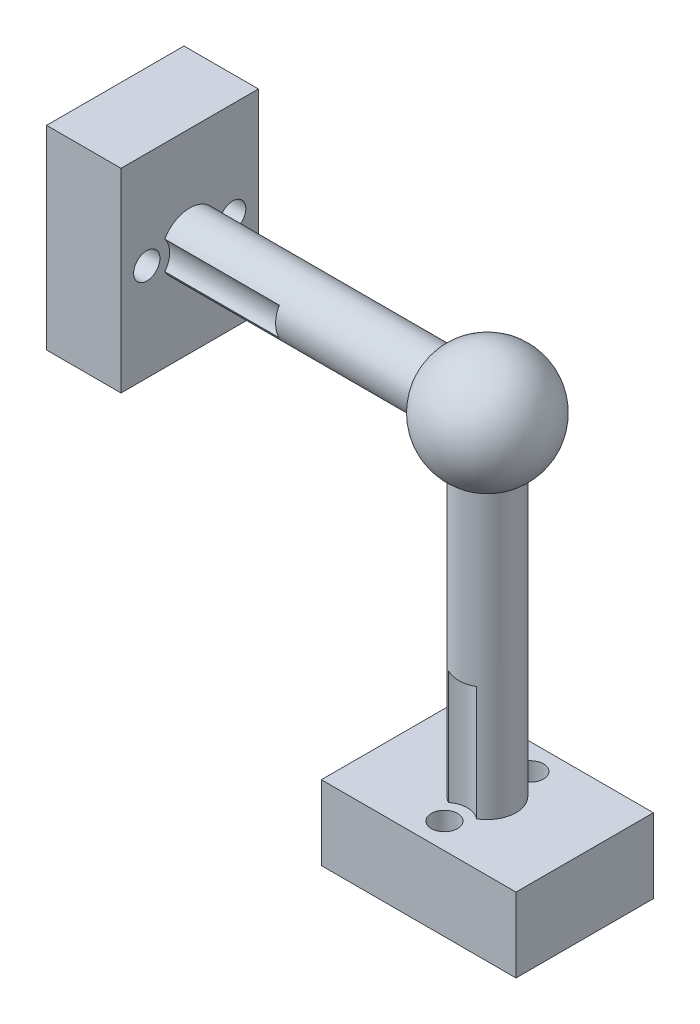
ISO-10303-21;
HEADER;
FILE_DESCRIPTION(('STEP AP214'),'2;1');
FILE_NAME('part.step','',(''),(''),'','','');
FILE_SCHEMA(('AUTOMOTIVE_DESIGN { 1 0 10303 214 1 1 1 1 }'));
ENDSEC;
DATA;
#1=APPLICATION_CONTEXT('core data for automotive mechanical design processes');
#2=APPLICATION_PROTOCOL_DEFINITION('international standard','automotive_design',2000,#1);
#3=PRODUCT_CONTEXT('',#1,'mechanical');
#4=PRODUCT('Part','Part','',(#3));
#5=PRODUCT_RELATED_PRODUCT_CATEGORY('part','',(#4));
#6=PRODUCT_DEFINITION_FORMATION('','',#4);
#7=PRODUCT_DEFINITION_CONTEXT('part definition',#1,'design');
#8=PRODUCT_DEFINITION('design','',#6,#7);
#9=PRODUCT_DEFINITION_SHAPE('','',#8);
#10=(LENGTH_UNIT() NAMED_UNIT(*) SI_UNIT(.MILLI.,.METRE.));
#11=(NAMED_UNIT(*) PLANE_ANGLE_UNIT() SI_UNIT($,.RADIAN.));
#12=(NAMED_UNIT(*) SI_UNIT($,.STERADIAN.) SOLID_ANGLE_UNIT());
#13=UNCERTAINTY_MEASURE_WITH_UNIT(LENGTH_MEASURE(1.E-05),#10,'distance_accuracy_value','');
#14=(GEOMETRIC_REPRESENTATION_CONTEXT(3) GLOBAL_UNCERTAINTY_ASSIGNED_CONTEXT((#13)) GLOBAL_UNIT_ASSIGNED_CONTEXT((#10,
#11,#12)) REPRESENTATION_CONTEXT('',''));
#15=CARTESIAN_POINT('',(0.,0.,0.));
#16=DIRECTION('',(0.,0.,1.));
#17=DIRECTION('',(1.,0.,0.));
#18=AXIS2_PLACEMENT_3D('',#15,#16,#17);
#19=CARTESIAN_POINT('',(-26.,0.,0.));
#20=DIRECTION('',(1.,0.,0.));
#21=DIRECTION('',(0.,0.,-1.));
#22=AXIS2_PLACEMENT_3D('',#19,#20,#21);
#23=CYLINDRICAL_SURFACE('',#22,2.5);
#24=CARTESIAN_POINT('',(-4.3301270189222,0.,0.));
#25=DIRECTION('',(1.,0.,0.));
#26=DIRECTION('',(0.,0.,-1.));
#27=AXIS2_PLACEMENT_3D('',#24,#25,#26);
#28=CIRCLE('',#27,2.5);
#29=CARTESIAN_POINT('',(-4.3301270189222,0.,-2.5));
#30=VERTEX_POINT('',#29);
#31=EDGE_CURVE('E240',#30,#30,#28,.F.);
#32=ORIENTED_EDGE('',*,*,#31,.T.);
#33=EDGE_LOOP('',(#32));
#34=FACE_BOUND('',#33,.T.);
#35=CARTESIAN_POINT('',(-16.,0.,0.));
#36=DIRECTION('',(1.,0.,0.));
#37=DIRECTION('',(0.,0.,-1.));
#38=AXIS2_PLACEMENT_3D('',#35,#36,#37);
#39=CIRCLE('',#38,2.5);
#40=CARTESIAN_POINT('',(-16.,1.23262930356211,-2.175));
#41=VERTEX_POINT('',#40);
#42=CARTESIAN_POINT('',(-16.,-1.23262930356211,-2.175));
#43=VERTEX_POINT('',#42);
#44=EDGE_CURVE('E11',#41,#43,#39,.F.);
#45=ORIENTED_EDGE('',*,*,#44,.F.);
#46=DIRECTION('',(-1.,0.,0.));
#47=VECTOR('',#46,1.);
#48=CARTESIAN_POINT('',(-21.,1.23262930356211,-2.175));
#49=LINE('',#48,#47);
#50=CARTESIAN_POINT('',(-26.,1.23262930356211,-2.175));
#51=VERTEX_POINT('',#50);
#52=EDGE_CURVE('E145',#41,#51,#49,.T.);
#53=ORIENTED_EDGE('',*,*,#52,.T.);
#54=CARTESIAN_POINT('',(-26.,0.,0.));
#55=DIRECTION('',(1.,0.,0.));
#56=DIRECTION('',(0.,0.,-1.));
#57=AXIS2_PLACEMENT_3D('',#54,#55,#56);
#58=CIRCLE('',#57,2.5);
#59=CARTESIAN_POINT('',(-26.,1.23262930356211,2.175));
#60=VERTEX_POINT('',#59);
#61=EDGE_CURVE('E156',#60,#51,#58,.F.);
#62=ORIENTED_EDGE('',*,*,#61,.F.);
#63=DIRECTION('',(-1.,0.,0.));
#64=VECTOR('',#63,1.);
#65=CARTESIAN_POINT('',(-21.,1.23262930356211,2.175));
#66=LINE('',#65,#64);
#67=CARTESIAN_POINT('',(-16.,1.23262930356211,2.175));
#68=VERTEX_POINT('',#67);
#69=EDGE_CURVE('E255',#60,#68,#66,.F.);
#70=ORIENTED_EDGE('',*,*,#69,.T.);
#71=CARTESIAN_POINT('',(-16.,0.,0.));
#72=DIRECTION('',(1.,0.,0.));
#73=DIRECTION('',(0.,0.,-1.));
#74=AXIS2_PLACEMENT_3D('',#71,#72,#73);
#75=CIRCLE('',#74,2.5);
#76=CARTESIAN_POINT('',(-16.,-1.23262930356211,2.175));
#77=VERTEX_POINT('',#76);
#78=EDGE_CURVE('E41',#77,#68,#75,.F.);
#79=ORIENTED_EDGE('',*,*,#78,.F.);
#80=DIRECTION('',(-1.,0.,0.));
#81=VECTOR('',#80,1.);
#82=CARTESIAN_POINT('',(-21.,-1.23262930356211,2.175));
#83=LINE('',#82,#81);
#84=CARTESIAN_POINT('',(-26.,-1.23262930356211,2.175));
#85=VERTEX_POINT('',#84);
#86=EDGE_CURVE('E256',#77,#85,#83,.T.);
#87=ORIENTED_EDGE('',*,*,#86,.T.);
#88=CARTESIAN_POINT('',(-26.,-1.23262930356211,-2.175));
#89=VERTEX_POINT('',#88);
#90=EDGE_CURVE('E161',#89,#85,#58,.F.);
#91=ORIENTED_EDGE('',*,*,#90,.F.);
#92=DIRECTION('',(-1.,0.,0.));
#93=VECTOR('',#92,1.);
#94=CARTESIAN_POINT('',(-21.,-1.23262930356211,-2.175));
#95=LINE('',#94,#93);
#96=EDGE_CURVE('E148',#89,#43,#95,.F.);
#97=ORIENTED_EDGE('',*,*,#96,.T.);
#98=EDGE_LOOP('',(#45,#53,#62,#70,#79,#87,#91,#97));
#99=FACE_BOUND('',#98,.T.);
#100=ADVANCED_FACE('F33',(#34,#99),#23,.T.);
#101=CARTESIAN_POINT('',(0.,-29.,0.));
#102=DIRECTION('',(0.,1.,0.));
#103=DIRECTION('',(0.,0.,1.));
#104=AXIS2_PLACEMENT_3D('',#101,#102,#103);
#105=CYLINDRICAL_SURFACE('',#104,2.5);
#106=CARTESIAN_POINT('',(0.,-4.3301270189222,0.));
#107=DIRECTION('',(0.,1.,0.));
#108=DIRECTION('',(0.,0.,1.));
#109=AXIS2_PLACEMENT_3D('',#106,#107,#108);
#110=CIRCLE('',#109,2.5);
#111=CARTESIAN_POINT('',(0.,-4.3301270189222,2.5));
#112=VERTEX_POINT('',#111);
#113=EDGE_CURVE('E237',#112,#112,#110,.F.);
#114=ORIENTED_EDGE('',*,*,#113,.T.);
#115=EDGE_LOOP('',(#114));
#116=FACE_BOUND('',#115,.T.);
#117=CARTESIAN_POINT('',(0.,-19.,0.));
#118=DIRECTION('',(0.,1.,0.));
#119=DIRECTION('',(-1.,0.,0.));
#120=AXIS2_PLACEMENT_3D('',#117,#118,#119);
#121=CIRCLE('',#120,2.5);
#122=CARTESIAN_POINT('',(1.23262930356202,-19.,2.17500000000005));
#123=VERTEX_POINT('',#122);
#124=CARTESIAN_POINT('',(-1.23262930356219,-19.,2.17499999999995));
#125=VERTEX_POINT('',#124);
#126=EDGE_CURVE('E245',#123,#125,#121,.F.);
#127=ORIENTED_EDGE('',*,*,#126,.F.);
#128=DIRECTION('',(0.,-1.,0.));
#129=VECTOR('',#128,1.);
#130=CARTESIAN_POINT('',(1.232629303562,-24.,2.17500000000006));
#131=LINE('',#130,#129);
#132=CARTESIAN_POINT('',(1.23262930356198,-29.,2.17500000000007));
#133=VERTEX_POINT('',#132);
#134=EDGE_CURVE('E174',#123,#133,#131,.T.);
#135=ORIENTED_EDGE('',*,*,#134,.T.);
#136=CARTESIAN_POINT('',(0.,-29.,0.));
#137=DIRECTION('',(0.,-1.,0.));
#138=DIRECTION('',(1.,0.,0.));
#139=AXIS2_PLACEMENT_3D('',#136,#137,#138);
#140=CIRCLE('',#139,2.5);
#141=CARTESIAN_POINT('',(1.23262930356198,-29.,-2.17500000000007));
#142=VERTEX_POINT('',#141);
#143=EDGE_CURVE('E228',#133,#142,#140,.F.);
#144=ORIENTED_EDGE('',*,*,#143,.T.);
#145=DIRECTION('',(0.,-1.,0.));
#146=VECTOR('',#145,1.);
#147=CARTESIAN_POINT('',(1.232629303562,-24.,-2.17500000000006));
#148=LINE('',#147,#146);
#149=CARTESIAN_POINT('',(1.23262930356202,-19.,-2.17500000000005));
#150=VERTEX_POINT('',#149);
#151=EDGE_CURVE('E181',#142,#150,#148,.F.);
#152=ORIENTED_EDGE('',*,*,#151,.T.);
#153=CARTESIAN_POINT('',(0.,-19.,0.));
#154=DIRECTION('',(0.,1.,0.));
#155=DIRECTION('',(-1.,0.,0.));
#156=AXIS2_PLACEMENT_3D('',#153,#154,#155);
#157=CIRCLE('',#156,2.5);
#158=CARTESIAN_POINT('',(-1.23262930356219,-19.,-2.17499999999995));
#159=VERTEX_POINT('',#158);
#160=EDGE_CURVE('E243',#159,#150,#157,.F.);
#161=ORIENTED_EDGE('',*,*,#160,.F.);
#162=DIRECTION('',(0.,-1.,0.));
#163=VECTOR('',#162,1.);
#164=CARTESIAN_POINT('',(-1.23262930356221,-24.,-2.17499999999994));
#165=LINE('',#164,#163);
#166=CARTESIAN_POINT('',(-1.23262930356223,-29.,-2.17499999999993));
#167=VERTEX_POINT('',#166);
#168=EDGE_CURVE('E186',#159,#167,#165,.T.);
#169=ORIENTED_EDGE('',*,*,#168,.T.);
#170=CARTESIAN_POINT('',(-1.23262930356223,-29.,2.17499999999993));
#171=VERTEX_POINT('',#170);
#172=EDGE_CURVE('E234',#167,#171,#140,.F.);
#173=ORIENTED_EDGE('',*,*,#172,.T.);
#174=DIRECTION('',(0.,-1.,0.));
#175=VECTOR('',#174,1.);
#176=CARTESIAN_POINT('',(-1.23262930356221,-24.,2.17499999999994));
#177=LINE('',#176,#175);
#178=EDGE_CURVE('E170',#171,#125,#177,.F.);
#179=ORIENTED_EDGE('',*,*,#178,.T.);
#180=EDGE_LOOP('',(#127,#135,#144,#152,#161,#169,#173,#179));
#181=FACE_BOUND('',#180,.T.);
#182=ADVANCED_FACE('F344',(#116,#181),#105,.T.);
#183=CARTESIAN_POINT('',(0.,0.,0.));
#184=DIRECTION('',(0.,1.,0.));
#185=DIRECTION('',(1.,0.,0.));
#186=AXIS2_PLACEMENT_3D('',#183,#184,#185);
#187=SPHERICAL_SURFACE('',#186,5.);
#188=ORIENTED_EDGE('',*,*,#31,.F.);
#189=EDGE_LOOP('',(#188));
#190=FACE_BOUND('',#189,.T.);
#191=ORIENTED_EDGE('',*,*,#113,.F.);
#192=EDGE_LOOP('',(#191));
#193=FACE_BOUND('',#192,.T.);
#194=ADVANCED_FACE('F35',(#190,#193),#187,.T.);
#195=CARTESIAN_POINT('',(8.49999999999984,-29.0000000000001,-6.));
#196=DIRECTION('',(1.,0.,0.));
#197=DIRECTION('',(0.,1.,0.));
#198=AXIS2_PLACEMENT_3D('',#195,#196,#197);
#199=PLANE('',#198);
#200=DIRECTION('',(0.,0.,1.));
#201=VECTOR('',#200,1.);
#202=CARTESIAN_POINT('',(8.49999999999979,-35.5000000000001,-6.));
#203=LINE('',#202,#201);
#204=CARTESIAN_POINT('',(8.49999999999979,-35.5000000000001,-6.));
#205=VERTEX_POINT('',#204);
#206=CARTESIAN_POINT('',(8.49999999999979,-35.5000000000001,6.));
#207=VERTEX_POINT('',#206);
#208=EDGE_CURVE('E199',#205,#207,#203,.T.);
#209=ORIENTED_EDGE('',*,*,#208,.F.);
#210=DIRECTION('',(0.,-1.,0.));
#211=VECTOR('',#210,1.);
#212=CARTESIAN_POINT('',(8.49999999999984,-29.0000000000001,-6.));
#213=LINE('',#212,#211);
#214=CARTESIAN_POINT('',(8.49999999999984,-29.0000000000001,-6.));
#215=VERTEX_POINT('',#214);
#216=EDGE_CURVE('E226',#215,#205,#213,.T.);
#217=ORIENTED_EDGE('',*,*,#216,.F.);
#218=DIRECTION('',(0.,0.,1.));
#219=VECTOR('',#218,1.);
#220=CARTESIAN_POINT('',(8.49999999999984,-29.0000000000001,-6.));
#221=LINE('',#220,#219);
#222=CARTESIAN_POINT('',(8.49999999999983,-29.0000000000001,6.));
#223=VERTEX_POINT('',#222);
#224=EDGE_CURVE('E202',#215,#223,#221,.T.);
#225=ORIENTED_EDGE('',*,*,#224,.T.);
#226=DIRECTION('',(0.,-1.,0.));
#227=VECTOR('',#226,1.);
#228=CARTESIAN_POINT('',(8.49999999999983,-29.0000000000001,6.));
#229=LINE('',#228,#227);
#230=EDGE_CURVE('E215',#223,#207,#229,.T.);
#231=ORIENTED_EDGE('',*,*,#230,.T.);
#232=EDGE_LOOP('',(#209,#217,#225,#231));
#233=FACE_BOUND('',#232,.T.);
#234=ADVANCED_FACE('F352',(#233),#199,.T.);
#235=CARTESIAN_POINT('',(8.49999999999984,-29.0000000000001,-6.));
#236=DIRECTION('',(0.,0.,-1.));
#237=DIRECTION('',(-1.,0.,0.));
#238=AXIS2_PLACEMENT_3D('',#235,#236,#237);
#239=PLANE('',#238);
#240=DIRECTION('',(1.,0.,0.));
#241=VECTOR('',#240,1.);
#242=CARTESIAN_POINT('',(8.49999999999979,-35.5000000000001,-6.));
#243=LINE('',#242,#241);
#244=CARTESIAN_POINT('',(-8.50000000000021,-35.4999999999999,-6.));
#245=VERTEX_POINT('',#244);
#246=EDGE_CURVE('E206',#245,#205,#243,.T.);
#247=ORIENTED_EDGE('',*,*,#246,.F.);
#248=DIRECTION('',(0.,-1.,0.));
#249=VECTOR('',#248,1.);
#250=CARTESIAN_POINT('',(-8.50000000000016,-28.9999999999999,-6.));
#251=LINE('',#250,#249);
#252=CARTESIAN_POINT('',(-8.50000000000016,-28.9999999999999,-6.));
#253=VERTEX_POINT('',#252);
#254=EDGE_CURVE('E229',#253,#245,#251,.T.);
#255=ORIENTED_EDGE('',*,*,#254,.F.);
#256=DIRECTION('',(1.,0.,0.));
#257=VECTOR('',#256,1.);
#258=CARTESIAN_POINT('',(8.49999999999984,-29.0000000000001,-6.));
#259=LINE('',#258,#257);
#260=EDGE_CURVE('E212',#253,#215,#259,.T.);
#261=ORIENTED_EDGE('',*,*,#260,.T.);
#262=ORIENTED_EDGE('',*,*,#216,.T.);
#263=EDGE_LOOP('',(#247,#255,#261,#262));
#264=FACE_BOUND('',#263,.T.);
#265=ADVANCED_FACE('F355',(#264),#239,.T.);
#266=CARTESIAN_POINT('',(-8.50000000000016,-28.9999999999999,-6.));
#267=DIRECTION('',(-1.,0.,0.));
#268=DIRECTION('',(0.,-1.,0.));
#269=AXIS2_PLACEMENT_3D('',#266,#267,#268);
#270=PLANE('',#269);
#271=DIRECTION('',(0.,0.,-1.));
#272=VECTOR('',#271,1.);
#273=CARTESIAN_POINT('',(-8.50000000000021,-35.4999999999999,-6.));
#274=LINE('',#273,#272);
#275=CARTESIAN_POINT('',(-8.50000000000021,-35.4999999999999,6.));
#276=VERTEX_POINT('',#275);
#277=EDGE_CURVE('E221',#276,#245,#274,.T.);
#278=ORIENTED_EDGE('',*,*,#277,.F.);
#279=DIRECTION('',(0.,-1.,0.));
#280=VECTOR('',#279,1.);
#281=CARTESIAN_POINT('',(-8.50000000000016,-28.9999999999999,6.));
#282=LINE('',#281,#280);
#283=CARTESIAN_POINT('',(-8.50000000000016,-28.9999999999999,6.));
#284=VERTEX_POINT('',#283);
#285=EDGE_CURVE('E231',#284,#276,#282,.T.);
#286=ORIENTED_EDGE('',*,*,#285,.F.);
#287=DIRECTION('',(0.,0.,-1.));
#288=VECTOR('',#287,1.);
#289=CARTESIAN_POINT('',(-8.50000000000016,-28.9999999999999,-6.));
#290=LINE('',#289,#288);
#291=EDGE_CURVE('E209',#284,#253,#290,.T.);
#292=ORIENTED_EDGE('',*,*,#291,.T.);
#293=ORIENTED_EDGE('',*,*,#254,.T.);
#294=EDGE_LOOP('',(#278,#286,#292,#293));
#295=FACE_BOUND('',#294,.T.);
#296=ADVANCED_FACE('F361',(#295),#270,.T.);
#297=CARTESIAN_POINT('',(8.49999999999983,-29.0000000000001,6.));
#298=DIRECTION('',(0.,0.,1.));
#299=DIRECTION('',(1.,0.,0.));
#300=AXIS2_PLACEMENT_3D('',#297,#298,#299);
#301=PLANE('',#300);
#302=DIRECTION('',(-1.,0.,0.));
#303=VECTOR('',#302,1.);
#304=CARTESIAN_POINT('',(8.49999999999979,-35.5000000000001,6.));
#305=LINE('',#304,#303);
#306=EDGE_CURVE('E218',#207,#276,#305,.T.);
#307=ORIENTED_EDGE('',*,*,#306,.F.);
#308=ORIENTED_EDGE('',*,*,#230,.F.);
#309=DIRECTION('',(-1.,0.,0.));
#310=VECTOR('',#309,1.);
#311=CARTESIAN_POINT('',(8.49999999999983,-29.0000000000001,6.));
#312=LINE('',#311,#310);
#313=EDGE_CURVE('E205',#223,#284,#312,.T.);
#314=ORIENTED_EDGE('',*,*,#313,.T.);
#315=ORIENTED_EDGE('',*,*,#285,.T.);
#316=EDGE_LOOP('',(#307,#308,#314,#315));
#317=FACE_BOUND('',#316,.T.);
#318=ADVANCED_FACE('F357',(#317),#301,.T.);
#319=CARTESIAN_POINT('',(-2.15431519336023E-13,-29.,0.));
#320=DIRECTION('',(0.,-1.,0.));
#321=DIRECTION('',(1.,0.,0.));
#322=AXIS2_PLACEMENT_3D('',#319,#320,#321);
#323=PLANE('',#322);
#324=ORIENTED_EDGE('',*,*,#143,.F.);
#325=CARTESIAN_POINT('',(-2.13932221610904E-13,-29.,3.75));
#326=DIRECTION('',(0.,1.,0.));
#327=DIRECTION('',(-1.,0.,0.));
#328=AXIS2_PLACEMENT_3D('',#325,#326,#327);
#329=CIRCLE('',#328,2.);
#330=EDGE_CURVE('E160',#133,#171,#329,.T.);
#331=ORIENTED_EDGE('',*,*,#330,.T.);
#332=ORIENTED_EDGE('',*,*,#172,.F.);
#333=CARTESIAN_POINT('',(-2.13932221610904E-13,-29.,-3.75));
#334=DIRECTION('',(0.,1.,0.));
#335=DIRECTION('',(-1.,0.,0.));
#336=AXIS2_PLACEMENT_3D('',#333,#334,#335);
#337=CIRCLE('',#336,2.);
#338=EDGE_CURVE('E177',#167,#142,#337,.T.);
#339=ORIENTED_EDGE('',*,*,#338,.T.);
#340=EDGE_LOOP('',(#324,#331,#332,#339));
#341=FACE_BOUND('',#340,.T.);
#342=ORIENTED_EDGE('',*,*,#224,.F.);
#343=ORIENTED_EDGE('',*,*,#260,.F.);
#344=ORIENTED_EDGE('',*,*,#291,.F.);
#345=ORIENTED_EDGE('',*,*,#313,.F.);
#346=EDGE_LOOP('',(#342,#343,#344,#345));
#347=FACE_BOUND('',#346,.T.);
#348=CARTESIAN_POINT('',(-1.64099622925627E-13,-29.,-3.75));
#349=DIRECTION('',(0.,-1.,0.));
#350=DIRECTION('',(1.,0.,0.));
#351=AXIS2_PLACEMENT_3D('',#348,#349,#350);
#352=CIRCLE('',#351,1.15);
#353=CARTESIAN_POINT('',(1.14999999999984,-29.,-3.75));
#354=VERTEX_POINT('',#353);
#355=EDGE_CURVE('E196',#354,#354,#352,.T.);
#356=ORIENTED_EDGE('',*,*,#355,.T.);
#357=EDGE_LOOP('',(#356));
#358=FACE_BOUND('',#357,.T.);
#359=CARTESIAN_POINT('',(-1.64099622925627E-13,-29.,3.75));
#360=DIRECTION('',(0.,-1.,0.));
#361=DIRECTION('',(1.,0.,0.));
#362=AXIS2_PLACEMENT_3D('',#359,#360,#361);
#363=CIRCLE('',#362,1.15);
#364=CARTESIAN_POINT('',(1.14999999999984,-29.,3.75));
#365=VERTEX_POINT('',#364);
#366=EDGE_CURVE('E190',#365,#365,#363,.T.);
#367=ORIENTED_EDGE('',*,*,#366,.T.);
#368=EDGE_LOOP('',(#367));
#369=FACE_BOUND('',#368,.T.);
#370=ADVANCED_FACE('F360',(#341,#347,#358,#369),#323,.F.);
#371=CARTESIAN_POINT('',(-2.60820776740983E-13,-35.5,0.));
#372=DIRECTION('',(0.,-1.,0.));
#373=DIRECTION('',(1.,0.,0.));
#374=AXIS2_PLACEMENT_3D('',#371,#372,#373);
#375=PLANE('',#374);
#376=CARTESIAN_POINT('',(-2.09488880330588E-13,-35.5,3.75));
#377=DIRECTION('',(0.,-1.,0.));
#378=DIRECTION('',(1.,0.,0.));
#379=AXIS2_PLACEMENT_3D('',#376,#377,#378);
#380=CIRCLE('',#379,1.15);
#381=CARTESIAN_POINT('',(1.14999999999979,-35.5,3.75));
#382=VERTEX_POINT('',#381);
#383=EDGE_CURVE('E189',#382,#382,#380,.T.);
#384=ORIENTED_EDGE('',*,*,#383,.F.);
#385=EDGE_LOOP('',(#384));
#386=FACE_BOUND('',#385,.T.);
#387=CARTESIAN_POINT('',(-2.09488880330588E-13,-35.5,-3.75));
#388=DIRECTION('',(0.,-1.,0.));
#389=DIRECTION('',(1.,0.,0.));
#390=AXIS2_PLACEMENT_3D('',#387,#388,#389);
#391=CIRCLE('',#390,1.15);
#392=CARTESIAN_POINT('',(1.14999999999979,-35.5,-3.75));
#393=VERTEX_POINT('',#392);
#394=EDGE_CURVE('E193',#393,#393,#391,.T.);
#395=ORIENTED_EDGE('',*,*,#394,.F.);
#396=EDGE_LOOP('',(#395));
#397=FACE_BOUND('',#396,.T.);
#398=ORIENTED_EDGE('',*,*,#208,.T.);
#399=ORIENTED_EDGE('',*,*,#306,.T.);
#400=ORIENTED_EDGE('',*,*,#277,.T.);
#401=ORIENTED_EDGE('',*,*,#246,.T.);
#402=EDGE_LOOP('',(#398,#399,#400,#401));
#403=FACE_BOUND('',#402,.T.);
#404=ADVANCED_FACE('F369',(#386,#397,#403),#375,.T.);
#405=CARTESIAN_POINT('',(-1.64099622925627E-13,-29.,-3.75));
#406=DIRECTION('',(0.,-1.,0.));
#407=DIRECTION('',(1.,0.,0.));
#408=AXIS2_PLACEMENT_3D('',#405,#406,#407);
#409=CYLINDRICAL_SURFACE('',#408,1.15);
#410=ORIENTED_EDGE('',*,*,#355,.F.);
#411=EDGE_LOOP('',(#410));
#412=FACE_BOUND('',#411,.T.);
#413=ORIENTED_EDGE('',*,*,#394,.T.);
#414=EDGE_LOOP('',(#413));
#415=FACE_BOUND('',#414,.T.);
#416=ADVANCED_FACE('F372',(#412,#415),#409,.F.);
#417=CARTESIAN_POINT('',(-1.64099622925627E-13,-29.,3.75));
#418=DIRECTION('',(0.,-1.,0.));
#419=DIRECTION('',(1.,0.,0.));
#420=AXIS2_PLACEMENT_3D('',#417,#418,#419);
#421=CYLINDRICAL_SURFACE('',#420,1.15);
#422=ORIENTED_EDGE('',*,*,#366,.F.);
#423=EDGE_LOOP('',(#422));
#424=FACE_BOUND('',#423,.T.);
#425=ORIENTED_EDGE('',*,*,#383,.T.);
#426=EDGE_LOOP('',(#425));
#427=FACE_BOUND('',#426,.T.);
#428=ADVANCED_FACE('F379',(#424,#427),#421,.F.);
#429=CARTESIAN_POINT('',(-1.44543282571832E-13,-19.,-3.75));
#430=DIRECTION('',(0.,-1.,0.));
#431=DIRECTION('',(1.,0.,0.));
#432=AXIS2_PLACEMENT_3D('',#429,#430,#431);
#433=CYLINDRICAL_SURFACE('',#432,2.);
#434=CARTESIAN_POINT('',(-1.44543282571832E-13,-19.,-3.75));
#435=DIRECTION('',(0.,1.,0.));
#436=DIRECTION('',(-1.,0.,0.));
#437=AXIS2_PLACEMENT_3D('',#434,#435,#436);
#438=CIRCLE('',#437,2.);
#439=EDGE_CURVE('E178',#159,#150,#438,.T.);
#440=ORIENTED_EDGE('',*,*,#439,.T.);
#441=ORIENTED_EDGE('',*,*,#151,.F.);
#442=ORIENTED_EDGE('',*,*,#338,.F.);
#443=ORIENTED_EDGE('',*,*,#168,.F.);
#444=EDGE_LOOP('',(#440,#441,#442,#443));
#445=FACE_BOUND('',#444,.T.);
#446=ADVANCED_FACE('F383',(#445),#433,.F.);
#447=CARTESIAN_POINT('',(-1.44543282571832E-13,-19.,-3.75));
#448=DIRECTION('',(0.,1.,0.));
#449=DIRECTION('',(-1.,0.,0.));
#450=AXIS2_PLACEMENT_3D('',#447,#448,#449);
#451=PLANE('',#450);
#452=ORIENTED_EDGE('',*,*,#160,.T.);
#453=ORIENTED_EDGE('',*,*,#439,.F.);
#454=EDGE_LOOP('',(#452,#453));
#455=FACE_BOUND('',#454,.T.);
#456=ADVANCED_FACE('F387',(#455),#451,.F.);
#457=CARTESIAN_POINT('',(-1.44543282571832E-13,-19.,3.75));
#458=DIRECTION('',(0.,-1.,0.));
#459=DIRECTION('',(1.,0.,0.));
#460=AXIS2_PLACEMENT_3D('',#457,#458,#459);
#461=CYLINDRICAL_SURFACE('',#460,2.);
#462=CARTESIAN_POINT('',(-1.44543282571832E-13,-19.,3.75));
#463=DIRECTION('',(0.,1.,0.));
#464=DIRECTION('',(-1.,0.,0.));
#465=AXIS2_PLACEMENT_3D('',#462,#463,#464);
#466=CIRCLE('',#465,2.);
#467=EDGE_CURVE('E163',#123,#125,#466,.T.);
#468=ORIENTED_EDGE('',*,*,#467,.T.);
#469=ORIENTED_EDGE('',*,*,#178,.F.);
#470=ORIENTED_EDGE('',*,*,#330,.F.);
#471=ORIENTED_EDGE('',*,*,#134,.F.);
#472=EDGE_LOOP('',(#468,#469,#470,#471));
#473=FACE_BOUND('',#472,.T.);
#474=ADVANCED_FACE('F391',(#473),#461,.F.);
#475=CARTESIAN_POINT('',(-1.44543282571832E-13,-19.,3.75));
#476=DIRECTION('',(0.,1.,0.));
#477=DIRECTION('',(-1.,0.,0.));
#478=AXIS2_PLACEMENT_3D('',#475,#476,#477);
#479=PLANE('',#478);
#480=ORIENTED_EDGE('',*,*,#126,.T.);
#481=ORIENTED_EDGE('',*,*,#467,.F.);
#482=EDGE_LOOP('',(#480,#481));
#483=FACE_BOUND('',#482,.T.);
#484=ADVANCED_FACE('F323',(#483),#479,.F.);
#485=CARTESIAN_POINT('',(-26.,0.,0.));
#486=DIRECTION('',(1.,0.,0.));
#487=DIRECTION('',(0.,0.,-1.));
#488=AXIS2_PLACEMENT_3D('',#485,#486,#487);
#489=PLANE('',#488);
#490=ORIENTED_EDGE('',*,*,#61,.T.);
#491=CARTESIAN_POINT('',(-26.,0.,-3.75));
#492=DIRECTION('',(1.,0.,0.));
#493=DIRECTION('',(0.,0.,-1.));
#494=AXIS2_PLACEMENT_3D('',#491,#492,#493);
#495=CIRCLE('',#494,2.);
#496=EDGE_CURVE('E48',#51,#89,#495,.T.);
#497=ORIENTED_EDGE('',*,*,#496,.T.);
#498=ORIENTED_EDGE('',*,*,#90,.T.);
#499=CARTESIAN_POINT('',(-26.,0.,3.75));
#500=DIRECTION('',(1.,0.,0.));
#501=DIRECTION('',(0.,0.,-1.));
#502=AXIS2_PLACEMENT_3D('',#499,#500,#501);
#503=CIRCLE('',#502,2.);
#504=EDGE_CURVE('E53',#85,#60,#503,.T.);
#505=ORIENTED_EDGE('',*,*,#504,.T.);
#506=EDGE_LOOP('',(#490,#497,#498,#505));
#507=FACE_BOUND('',#506,.T.);
#508=DIRECTION('',(0.,1.,0.));
#509=VECTOR('',#508,1.);
#510=CARTESIAN_POINT('',(-26.,-8.5,-6.));
#511=LINE('',#510,#509);
#512=CARTESIAN_POINT('',(-26.,-8.5,-6.));
#513=VERTEX_POINT('',#512);
#514=CARTESIAN_POINT('',(-26.,8.5,-6.));
#515=VERTEX_POINT('',#514);
#516=EDGE_CURVE('E275',#513,#515,#511,.T.);
#517=ORIENTED_EDGE('',*,*,#516,.T.);
#518=DIRECTION('',(0.,0.,1.));
#519=VECTOR('',#518,1.);
#520=CARTESIAN_POINT('',(-26.,8.5,-6.));
#521=LINE('',#520,#519);
#522=CARTESIAN_POINT('',(-26.,8.5,6.));
#523=VERTEX_POINT('',#522);
#524=EDGE_CURVE('E278',#515,#523,#521,.T.);
#525=ORIENTED_EDGE('',*,*,#524,.T.);
#526=DIRECTION('',(0.,-1.,0.));
#527=VECTOR('',#526,1.);
#528=CARTESIAN_POINT('',(-26.,-8.5,6.));
#529=LINE('',#528,#527);
#530=CARTESIAN_POINT('',(-26.,-8.5,6.));
#531=VERTEX_POINT('',#530);
#532=EDGE_CURVE('E281',#523,#531,#529,.T.);
#533=ORIENTED_EDGE('',*,*,#532,.T.);
#534=DIRECTION('',(0.,0.,-1.));
#535=VECTOR('',#534,1.);
#536=CARTESIAN_POINT('',(-26.,-8.5,-6.));
#537=LINE('',#536,#535);
#538=EDGE_CURVE('E283',#531,#513,#537,.T.);
#539=ORIENTED_EDGE('',*,*,#538,.T.);
#540=EDGE_LOOP('',(#517,#525,#533,#539));
#541=FACE_BOUND('',#540,.T.);
#542=CARTESIAN_POINT('',(-26.,0.,3.75));
#543=DIRECTION('',(1.,0.,0.));
#544=DIRECTION('',(0.,0.,-1.));
#545=AXIS2_PLACEMENT_3D('',#542,#543,#544);
#546=CIRCLE('',#545,1.15);
#547=CARTESIAN_POINT('',(-26.,0.,2.6));
#548=VERTEX_POINT('',#547);
#549=EDGE_CURVE('E269',#548,#548,#546,.T.);
#550=ORIENTED_EDGE('',*,*,#549,.F.);
#551=EDGE_LOOP('',(#550));
#552=FACE_BOUND('',#551,.T.);
#553=CARTESIAN_POINT('',(-26.,0.,-3.75));
#554=DIRECTION('',(1.,0.,0.));
#555=DIRECTION('',(0.,0.,-1.));
#556=AXIS2_PLACEMENT_3D('',#553,#554,#555);
#557=CIRCLE('',#556,1.15);
#558=CARTESIAN_POINT('',(-26.,0.,-4.9));
#559=VERTEX_POINT('',#558);
#560=EDGE_CURVE('E263',#559,#559,#557,.T.);
#561=ORIENTED_EDGE('',*,*,#560,.F.);
#562=EDGE_LOOP('',(#561));
#563=FACE_BOUND('',#562,.T.);
#564=ADVANCED_FACE('F158',(#507,#541,#552,#563),#489,.T.);
#565=CARTESIAN_POINT('',(-32.5,0.,0.));
#566=DIRECTION('',(1.,0.,0.));
#567=DIRECTION('',(0.,0.,-1.));
#568=AXIS2_PLACEMENT_3D('',#565,#566,#567);
#569=PLANE('',#568);
#570=DIRECTION('',(0.,1.,0.));
#571=VECTOR('',#570,1.);
#572=CARTESIAN_POINT('',(-32.5,-8.5,-6.));
#573=LINE('',#572,#571);
#574=CARTESIAN_POINT('',(-32.5,-8.5,-6.));
#575=VERTEX_POINT('',#574);
#576=CARTESIAN_POINT('',(-32.5,8.5,-6.));
#577=VERTEX_POINT('',#576);
#578=EDGE_CURVE('E272',#575,#577,#573,.T.);
#579=ORIENTED_EDGE('',*,*,#578,.F.);
#580=DIRECTION('',(0.,0.,-1.));
#581=VECTOR('',#580,1.);
#582=CARTESIAN_POINT('',(-32.5,-8.5,-6.));
#583=LINE('',#582,#581);
#584=CARTESIAN_POINT('',(-32.5,-8.5,6.));
#585=VERTEX_POINT('',#584);
#586=EDGE_CURVE('E279',#585,#575,#583,.T.);
#587=ORIENTED_EDGE('',*,*,#586,.F.);
#588=DIRECTION('',(0.,-1.,0.));
#589=VECTOR('',#588,1.);
#590=CARTESIAN_POINT('',(-32.5,-8.5,6.));
#591=LINE('',#590,#589);
#592=CARTESIAN_POINT('',(-32.5,8.5,6.));
#593=VERTEX_POINT('',#592);
#594=EDGE_CURVE('E290',#593,#585,#591,.T.);
#595=ORIENTED_EDGE('',*,*,#594,.F.);
#596=DIRECTION('',(0.,0.,1.));
#597=VECTOR('',#596,1.);
#598=CARTESIAN_POINT('',(-32.5,8.5,-6.));
#599=LINE('',#598,#597);
#600=EDGE_CURVE('E288',#577,#593,#599,.T.);
#601=ORIENTED_EDGE('',*,*,#600,.F.);
#602=EDGE_LOOP('',(#579,#587,#595,#601));
#603=FACE_BOUND('',#602,.T.);
#604=CARTESIAN_POINT('',(-32.5,0.,3.75));
#605=DIRECTION('',(1.,0.,0.));
#606=DIRECTION('',(0.,0.,-1.));
#607=AXIS2_PLACEMENT_3D('',#604,#605,#606);
#608=CIRCLE('',#607,1.15);
#609=CARTESIAN_POINT('',(-32.5,0.,2.6));
#610=VERTEX_POINT('',#609);
#611=EDGE_CURVE('E266',#610,#610,#608,.T.);
#612=ORIENTED_EDGE('',*,*,#611,.T.);
#613=EDGE_LOOP('',(#612));
#614=FACE_BOUND('',#613,.T.);
#615=CARTESIAN_POINT('',(-32.5,0.,-3.75));
#616=DIRECTION('',(1.,0.,0.));
#617=DIRECTION('',(0.,0.,-1.));
#618=AXIS2_PLACEMENT_3D('',#615,#616,#617);
#619=CIRCLE('',#618,1.15);
#620=CARTESIAN_POINT('',(-32.5,0.,-4.9));
#621=VERTEX_POINT('',#620);
#622=EDGE_CURVE('E259',#621,#621,#619,.T.);
#623=ORIENTED_EDGE('',*,*,#622,.T.);
#624=EDGE_LOOP('',(#623));
#625=FACE_BOUND('',#624,.T.);
#626=ADVANCED_FACE('F314',(#603,#614,#625),#569,.F.);
#627=CARTESIAN_POINT('',(-26.,-8.5,-6.));
#628=DIRECTION('',(0.,0.,1.));
#629=DIRECTION('',(0.,-1.,0.));
#630=AXIS2_PLACEMENT_3D('',#627,#628,#629);
#631=PLANE('',#630);
#632=ORIENTED_EDGE('',*,*,#578,.T.);
#633=DIRECTION('',(-1.,0.,0.));
#634=VECTOR('',#633,1.);
#635=CARTESIAN_POINT('',(-26.,8.5,-6.));
#636=LINE('',#635,#634);
#637=EDGE_CURVE('E165',#515,#577,#636,.T.);
#638=ORIENTED_EDGE('',*,*,#637,.F.);
#639=ORIENTED_EDGE('',*,*,#516,.F.);
#640=DIRECTION('',(-1.,0.,0.));
#641=VECTOR('',#640,1.);
#642=CARTESIAN_POINT('',(-26.,-8.5,-6.));
#643=LINE('',#642,#641);
#644=EDGE_CURVE('E285',#513,#575,#643,.T.);
#645=ORIENTED_EDGE('',*,*,#644,.T.);
#646=EDGE_LOOP('',(#632,#638,#639,#645));
#647=FACE_BOUND('',#646,.T.);
#648=ADVANCED_FACE('F310',(#647),#631,.F.);
#649=CARTESIAN_POINT('',(-26.,8.5,-6.));
#650=DIRECTION('',(0.,-1.,0.));
#651=DIRECTION('',(0.,0.,-1.));
#652=AXIS2_PLACEMENT_3D('',#649,#650,#651);
#653=PLANE('',#652);
#654=ORIENTED_EDGE('',*,*,#600,.T.);
#655=DIRECTION('',(-1.,0.,0.));
#656=VECTOR('',#655,1.);
#657=CARTESIAN_POINT('',(-26.,8.5,6.));
#658=LINE('',#657,#656);
#659=EDGE_CURVE('E297',#523,#593,#658,.T.);
#660=ORIENTED_EDGE('',*,*,#659,.F.);
#661=ORIENTED_EDGE('',*,*,#524,.F.);
#662=ORIENTED_EDGE('',*,*,#637,.T.);
#663=EDGE_LOOP('',(#654,#660,#661,#662));
#664=FACE_BOUND('',#663,.T.);
#665=ADVANCED_FACE('F306',(#664),#653,.F.);
#666=CARTESIAN_POINT('',(-26.,-8.5,6.));
#667=DIRECTION('',(0.,0.,-1.));
#668=DIRECTION('',(0.,1.,0.));
#669=AXIS2_PLACEMENT_3D('',#666,#667,#668);
#670=PLANE('',#669);
#671=ORIENTED_EDGE('',*,*,#594,.T.);
#672=DIRECTION('',(-1.,0.,0.));
#673=VECTOR('',#672,1.);
#674=CARTESIAN_POINT('',(-26.,-8.5,6.));
#675=LINE('',#674,#673);
#676=EDGE_CURVE('E295',#531,#585,#675,.T.);
#677=ORIENTED_EDGE('',*,*,#676,.F.);
#678=ORIENTED_EDGE('',*,*,#532,.F.);
#679=ORIENTED_EDGE('',*,*,#659,.T.);
#680=EDGE_LOOP('',(#671,#677,#678,#679));
#681=FACE_BOUND('',#680,.T.);
#682=ADVANCED_FACE('F317',(#681),#670,.F.);
#683=CARTESIAN_POINT('',(-26.,-8.5,-6.));
#684=DIRECTION('',(0.,1.,0.));
#685=DIRECTION('',(0.,0.,1.));
#686=AXIS2_PLACEMENT_3D('',#683,#684,#685);
#687=PLANE('',#686);
#688=ORIENTED_EDGE('',*,*,#586,.T.);
#689=ORIENTED_EDGE('',*,*,#644,.F.);
#690=ORIENTED_EDGE('',*,*,#538,.F.);
#691=ORIENTED_EDGE('',*,*,#676,.T.);
#692=EDGE_LOOP('',(#688,#689,#690,#691));
#693=FACE_BOUND('',#692,.T.);
#694=ADVANCED_FACE('F320',(#693),#687,.F.);
#695=CARTESIAN_POINT('',(-26.,0.,3.75));
#696=DIRECTION('',(-1.,0.,0.));
#697=DIRECTION('',(0.,0.,1.));
#698=AXIS2_PLACEMENT_3D('',#695,#696,#697);
#699=CYLINDRICAL_SURFACE('',#698,1.15);
#700=ORIENTED_EDGE('',*,*,#549,.T.);
#701=EDGE_LOOP('',(#700));
#702=FACE_BOUND('',#701,.T.);
#703=ORIENTED_EDGE('',*,*,#611,.F.);
#704=EDGE_LOOP('',(#703));
#705=FACE_BOUND('',#704,.T.);
#706=ADVANCED_FACE('F332',(#702,#705),#699,.F.);
#707=CARTESIAN_POINT('',(-26.,0.,-3.75));
#708=DIRECTION('',(-1.,0.,0.));
#709=DIRECTION('',(0.,0.,1.));
#710=AXIS2_PLACEMENT_3D('',#707,#708,#709);
#711=CYLINDRICAL_SURFACE('',#710,1.15);
#712=ORIENTED_EDGE('',*,*,#560,.T.);
#713=EDGE_LOOP('',(#712));
#714=FACE_BOUND('',#713,.T.);
#715=ORIENTED_EDGE('',*,*,#622,.F.);
#716=EDGE_LOOP('',(#715));
#717=FACE_BOUND('',#716,.T.);
#718=ADVANCED_FACE('F329',(#714,#717),#711,.F.);
#719=CARTESIAN_POINT('',(-16.,0.,3.75));
#720=DIRECTION('',(-1.,0.,0.));
#721=DIRECTION('',(0.,0.,1.));
#722=AXIS2_PLACEMENT_3D('',#719,#720,#721);
#723=CYLINDRICAL_SURFACE('',#722,2.);
#724=CARTESIAN_POINT('',(-16.,0.,3.75));
#725=DIRECTION('',(1.,0.,0.));
#726=DIRECTION('',(0.,0.,-1.));
#727=AXIS2_PLACEMENT_3D('',#724,#725,#726);
#728=CIRCLE('',#727,2.);
#729=EDGE_CURVE('E251',#77,#68,#728,.T.);
#730=ORIENTED_EDGE('',*,*,#729,.T.);
#731=ORIENTED_EDGE('',*,*,#69,.F.);
#732=ORIENTED_EDGE('',*,*,#504,.F.);
#733=ORIENTED_EDGE('',*,*,#86,.F.);
#734=EDGE_LOOP('',(#730,#731,#732,#733));
#735=FACE_BOUND('',#734,.T.);
#736=ADVANCED_FACE('F254',(#735),#723,.F.);
#737=CARTESIAN_POINT('',(-16.,0.,3.75));
#738=DIRECTION('',(1.,0.,0.));
#739=DIRECTION('',(0.,0.,-1.));
#740=AXIS2_PLACEMENT_3D('',#737,#738,#739);
#741=PLANE('',#740);
#742=ORIENTED_EDGE('',*,*,#78,.T.);
#743=ORIENTED_EDGE('',*,*,#729,.F.);
#744=EDGE_LOOP('',(#742,#743));
#745=FACE_BOUND('',#744,.T.);
#746=ADVANCED_FACE('F250',(#745),#741,.F.);
#747=CARTESIAN_POINT('',(-16.,0.,-3.75));
#748=DIRECTION('',(-1.,0.,0.));
#749=DIRECTION('',(0.,0.,1.));
#750=AXIS2_PLACEMENT_3D('',#747,#748,#749);
#751=CYLINDRICAL_SURFACE('',#750,2.);
#752=CARTESIAN_POINT('',(-16.,0.,-3.75));
#753=DIRECTION('',(1.,0.,0.));
#754=DIRECTION('',(0.,0.,-1.));
#755=AXIS2_PLACEMENT_3D('',#752,#753,#754);
#756=CIRCLE('',#755,2.);
#757=EDGE_CURVE('E150',#41,#43,#756,.T.);
#758=ORIENTED_EDGE('',*,*,#757,.T.);
#759=ORIENTED_EDGE('',*,*,#96,.F.);
#760=ORIENTED_EDGE('',*,*,#496,.F.);
#761=ORIENTED_EDGE('',*,*,#52,.F.);
#762=EDGE_LOOP('',(#758,#759,#760,#761));
#763=FACE_BOUND('',#762,.T.);
#764=ADVANCED_FACE('F144',(#763),#751,.F.);
#765=CARTESIAN_POINT('',(-16.,0.,-3.75));
#766=DIRECTION('',(1.,0.,0.));
#767=DIRECTION('',(0.,0.,-1.));
#768=AXIS2_PLACEMENT_3D('',#765,#766,#767);
#769=PLANE('',#768);
#770=ORIENTED_EDGE('',*,*,#44,.T.);
#771=ORIENTED_EDGE('',*,*,#757,.F.);
#772=EDGE_LOOP('',(#770,#771));
#773=FACE_BOUND('',#772,.T.);
#774=ADVANCED_FACE('F418',(#773),#769,.F.);
#775=CLOSED_SHELL('',(#100,#182,#194,#234,#265,#296,#318,#370,#404,#416,#428,#446,#456,#474,
#484,#564,#626,#648,#665,#682,#694,#706,#718,#736,#746,#764,#774));
#776=MANIFOLD_SOLID_BREP('B2',#775);
#777=ADVANCED_BREP_SHAPE_REPRESENTATION('',(#18,#776),#14);
#778=SHAPE_DEFINITION_REPRESENTATION(#9,#777);
ENDSEC;
END-ISO-10303-21;
